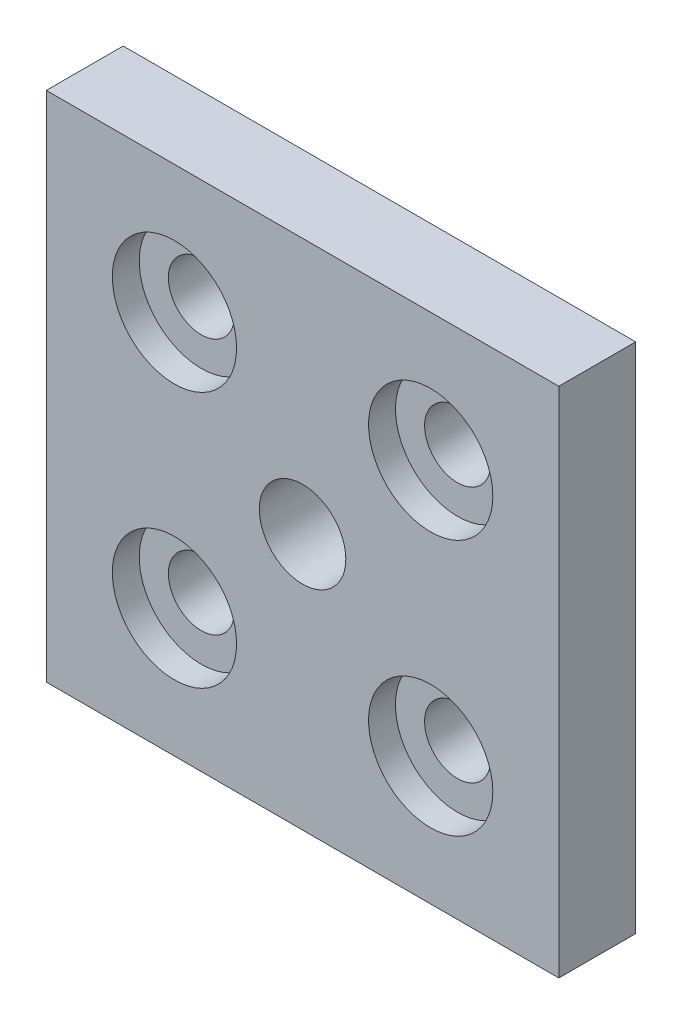
ISO-10303-21;
HEADER;
FILE_DESCRIPTION(('STEP AP214'),'2;1');
FILE_NAME('part.step','',(''),(''),'','','');
FILE_SCHEMA(('AUTOMOTIVE_DESIGN { 1 0 10303 214 1 1 1 1 }'));
ENDSEC;
DATA;
#1=APPLICATION_CONTEXT('core data for automotive mechanical design processes');
#2=APPLICATION_PROTOCOL_DEFINITION('international standard','automotive_design',2000,#1);
#3=PRODUCT_CONTEXT('',#1,'mechanical');
#4=PRODUCT('Part','Part','',(#3));
#5=PRODUCT_RELATED_PRODUCT_CATEGORY('part','',(#4));
#6=PRODUCT_DEFINITION_FORMATION('','',#4);
#7=PRODUCT_DEFINITION_CONTEXT('part definition',#1,'design');
#8=PRODUCT_DEFINITION('design','',#6,#7);
#9=PRODUCT_DEFINITION_SHAPE('','',#8);
#10=(LENGTH_UNIT() NAMED_UNIT(*) SI_UNIT(.MILLI.,.METRE.));
#11=(NAMED_UNIT(*) PLANE_ANGLE_UNIT() SI_UNIT($,.RADIAN.));
#12=(NAMED_UNIT(*) SI_UNIT($,.STERADIAN.) SOLID_ANGLE_UNIT());
#13=UNCERTAINTY_MEASURE_WITH_UNIT(LENGTH_MEASURE(1.E-05),#10,'distance_accuracy_value','');
#14=(GEOMETRIC_REPRESENTATION_CONTEXT(3) GLOBAL_UNCERTAINTY_ASSIGNED_CONTEXT((#13)) GLOBAL_UNIT_ASSIGNED_CONTEXT((#10,
#11,#12)) REPRESENTATION_CONTEXT('',''));
#15=CARTESIAN_POINT('',(0.,0.,0.));
#16=DIRECTION('',(0.,0.,1.));
#17=DIRECTION('',(1.,0.,0.));
#18=AXIS2_PLACEMENT_3D('',#15,#16,#17);
#19=CARTESIAN_POINT('',(1016.7489301358,986.409766940549,999.842344606397));
#20=DIRECTION('',(-1.,0.,0.));
#21=DIRECTION('',(0.,0.,1.));
#22=AXIS2_PLACEMENT_3D('',#19,#20,#21);
#23=PLANE('',#22);
#24=DIRECTION('',(0.,1.,0.));
#25=VECTOR('',#24,1.);
#26=CARTESIAN_POINT('',(1016.7489301358,986.409766940549,993.842344606397));
#27=LINE('',#26,#25);
#28=CARTESIAN_POINT('',(1016.7489301358,986.409766940549,993.842344606397));
#29=VERTEX_POINT('',#28);
#30=CARTESIAN_POINT('',(1016.7489301358,1026.40976694055,993.842344606397));
#31=VERTEX_POINT('',#30);
#32=EDGE_CURVE('E79',#29,#31,#27,.T.);
#33=ORIENTED_EDGE('',*,*,#32,.T.);
#34=DIRECTION('',(0.,0.,-1.));
#35=VECTOR('',#34,1.);
#36=CARTESIAN_POINT('',(1016.7489301358,1026.40976694055,999.842344606397));
#37=LINE('',#36,#35);
#38=CARTESIAN_POINT('',(1016.7489301358,1026.40976694055,999.842344606397));
#39=VERTEX_POINT('',#38);
#40=EDGE_CURVE('E10',#39,#31,#37,.T.);
#41=ORIENTED_EDGE('',*,*,#40,.F.);
#42=DIRECTION('',(0.,1.,0.));
#43=VECTOR('',#42,1.);
#44=CARTESIAN_POINT('',(1016.7489301358,986.409766940549,999.842344606397));
#45=LINE('',#44,#43);
#46=CARTESIAN_POINT('',(1016.7489301358,986.409766940549,999.842344606397));
#47=VERTEX_POINT('',#46);
#48=EDGE_CURVE('E67',#47,#39,#45,.T.);
#49=ORIENTED_EDGE('',*,*,#48,.F.);
#50=DIRECTION('',(0.,0.,-1.));
#51=VECTOR('',#50,1.);
#52=CARTESIAN_POINT('',(1016.7489301358,986.409766940549,999.842344606397));
#53=LINE('',#52,#51);
#54=EDGE_CURVE('E75',#47,#29,#53,.T.);
#55=ORIENTED_EDGE('',*,*,#54,.T.);
#56=EDGE_LOOP('',(#33,#41,#49,#55));
#57=FACE_BOUND('',#56,.T.);
#58=ADVANCED_FACE('F16',(#57),#23,.F.);
#59=CARTESIAN_POINT('',(976.748930135803,1026.40976694055,999.842344606397));
#60=DIRECTION('',(0.,-1.,0.));
#61=DIRECTION('',(0.,0.,-1.));
#62=AXIS2_PLACEMENT_3D('',#59,#60,#61);
#63=PLANE('',#62);
#64=DIRECTION('',(-1.,0.,0.));
#65=VECTOR('',#64,1.);
#66=CARTESIAN_POINT('',(976.748930135803,1026.40976694055,993.842344606397));
#67=LINE('',#66,#65);
#68=CARTESIAN_POINT('',(976.748930135803,1026.40976694055,993.842344606397));
#69=VERTEX_POINT('',#68);
#70=EDGE_CURVE('E71',#31,#69,#67,.T.);
#71=ORIENTED_EDGE('',*,*,#70,.T.);
#72=DIRECTION('',(0.,0.,-1.));
#73=VECTOR('',#72,1.);
#74=CARTESIAN_POINT('',(976.748930135803,1026.40976694055,999.842344606397));
#75=LINE('',#74,#73);
#76=CARTESIAN_POINT('',(976.748930135803,1026.40976694055,999.842344606397));
#77=VERTEX_POINT('',#76);
#78=EDGE_CURVE('E24',#77,#69,#75,.T.);
#79=ORIENTED_EDGE('',*,*,#78,.F.);
#80=DIRECTION('',(-1.,0.,0.));
#81=VECTOR('',#80,1.);
#82=CARTESIAN_POINT('',(976.748930135803,1026.40976694055,999.842344606397));
#83=LINE('',#82,#81);
#84=EDGE_CURVE('E62',#39,#77,#83,.T.);
#85=ORIENTED_EDGE('',*,*,#84,.F.);
#86=ORIENTED_EDGE('',*,*,#40,.T.);
#87=EDGE_LOOP('',(#71,#79,#85,#86));
#88=FACE_BOUND('',#87,.T.);
#89=ADVANCED_FACE('F70',(#88),#63,.F.);
#90=CARTESIAN_POINT('',(976.748930135803,986.409766940549,999.842344606397));
#91=DIRECTION('',(1.,0.,0.));
#92=DIRECTION('',(0.,0.,-1.));
#93=AXIS2_PLACEMENT_3D('',#90,#91,#92);
#94=PLANE('',#93);
#95=DIRECTION('',(0.,-1.,0.));
#96=VECTOR('',#95,1.);
#97=CARTESIAN_POINT('',(976.748930135803,986.409766940549,993.842344606397));
#98=LINE('',#97,#96);
#99=CARTESIAN_POINT('',(976.748930135803,986.409766940549,993.842344606397));
#100=VERTEX_POINT('',#99);
#101=EDGE_CURVE('E49',#69,#100,#98,.T.);
#102=ORIENTED_EDGE('',*,*,#101,.T.);
#103=DIRECTION('',(0.,0.,-1.));
#104=VECTOR('',#103,1.);
#105=CARTESIAN_POINT('',(976.748930135803,986.409766940549,999.842344606397));
#106=LINE('',#105,#104);
#107=CARTESIAN_POINT('',(976.748930135803,986.409766940549,999.842344606397));
#108=VERTEX_POINT('',#107);
#109=EDGE_CURVE('E72',#108,#100,#106,.T.);
#110=ORIENTED_EDGE('',*,*,#109,.F.);
#111=DIRECTION('',(0.,-1.,0.));
#112=VECTOR('',#111,1.);
#113=CARTESIAN_POINT('',(976.748930135803,986.409766940549,999.842344606397));
#114=LINE('',#113,#112);
#115=EDGE_CURVE('E65',#77,#108,#114,.T.);
#116=ORIENTED_EDGE('',*,*,#115,.F.);
#117=ORIENTED_EDGE('',*,*,#78,.T.);
#118=EDGE_LOOP('',(#102,#110,#116,#117));
#119=FACE_BOUND('',#118,.T.);
#120=ADVANCED_FACE('F73',(#119),#94,.F.);
#121=CARTESIAN_POINT('',(976.748930135803,986.409766940549,999.842344606397));
#122=DIRECTION('',(0.,1.,0.));
#123=DIRECTION('',(0.,0.,1.));
#124=AXIS2_PLACEMENT_3D('',#121,#122,#123);
#125=PLANE('',#124);
#126=DIRECTION('',(1.,0.,0.));
#127=VECTOR('',#126,1.);
#128=CARTESIAN_POINT('',(976.748930135803,986.409766940549,993.842344606397));
#129=LINE('',#128,#127);
#130=EDGE_CURVE('E55',#100,#29,#129,.T.);
#131=ORIENTED_EDGE('',*,*,#130,.T.);
#132=ORIENTED_EDGE('',*,*,#54,.F.);
#133=DIRECTION('',(1.,0.,0.));
#134=VECTOR('',#133,1.);
#135=CARTESIAN_POINT('',(976.748930135803,986.409766940549,999.842344606397));
#136=LINE('',#135,#134);
#137=EDGE_CURVE('E32',#108,#47,#136,.T.);
#138=ORIENTED_EDGE('',*,*,#137,.F.);
#139=ORIENTED_EDGE('',*,*,#109,.T.);
#140=EDGE_LOOP('',(#131,#132,#138,#139));
#141=FACE_BOUND('',#140,.T.);
#142=ADVANCED_FACE('F87',(#141),#125,.F.);
#143=CARTESIAN_POINT('',(996.748930135803,1006.40976694055,999.842344606397));
#144=DIRECTION('',(0.,0.,-1.));
#145=DIRECTION('',(-1.,0.,0.));
#146=AXIS2_PLACEMENT_3D('',#143,#144,#145);
#147=PLANE('',#146);
#148=CARTESIAN_POINT('',(996.748930135803,1006.40976694055,999.842344606397));
#149=DIRECTION('',(0.,0.,1.));
#150=DIRECTION('',(1.,0.,0.));
#151=AXIS2_PLACEMENT_3D('',#148,#149,#150);
#152=CIRCLE('',#151,3.375);
#153=CARTESIAN_POINT('',(1000.1239301358,1006.40976694055,999.842344606397));
#154=VERTEX_POINT('',#153);
#155=EDGE_CURVE('E141',#154,#154,#152,.T.);
#156=ORIENTED_EDGE('',*,*,#155,.F.);
#157=EDGE_LOOP('',(#156));
#158=FACE_BOUND('',#157,.T.);
#159=CARTESIAN_POINT('',(1006.7489301358,1016.40976694055,999.842344606397));
#160=DIRECTION('',(0.,0.,1.));
#161=DIRECTION('',(1.,0.,0.));
#162=AXIS2_PLACEMENT_3D('',#159,#160,#161);
#163=CIRCLE('',#162,4.85);
#164=CARTESIAN_POINT('',(1011.5989301358,1016.40976694055,999.842344606397));
#165=VERTEX_POINT('',#164);
#166=EDGE_CURVE('E96',#165,#165,#163,.T.);
#167=ORIENTED_EDGE('',*,*,#166,.F.);
#168=EDGE_LOOP('',(#167));
#169=FACE_BOUND('',#168,.T.);
#170=CARTESIAN_POINT('',(986.748930135803,996.409766940549,999.842344606397));
#171=DIRECTION('',(0.,0.,1.));
#172=DIRECTION('',(1.,0.,0.));
#173=AXIS2_PLACEMENT_3D('',#170,#171,#172);
#174=CIRCLE('',#173,4.85);
#175=CARTESIAN_POINT('',(991.598930135803,996.409766940549,999.842344606397));
#176=VERTEX_POINT('',#175);
#177=EDGE_CURVE('E102',#176,#176,#174,.T.);
#178=ORIENTED_EDGE('',*,*,#177,.F.);
#179=EDGE_LOOP('',(#178));
#180=FACE_BOUND('',#179,.T.);
#181=CARTESIAN_POINT('',(1006.7489301358,996.409766940549,999.842344606397));
#182=DIRECTION('',(0.,0.,1.));
#183=DIRECTION('',(1.,0.,0.));
#184=AXIS2_PLACEMENT_3D('',#181,#182,#183);
#185=CIRCLE('',#184,4.85);
#186=CARTESIAN_POINT('',(1011.5989301358,996.409766940549,999.842344606397));
#187=VERTEX_POINT('',#186);
#188=EDGE_CURVE('E103',#187,#187,#185,.T.);
#189=ORIENTED_EDGE('',*,*,#188,.F.);
#190=EDGE_LOOP('',(#189));
#191=FACE_BOUND('',#190,.T.);
#192=CARTESIAN_POINT('',(986.748930135803,1016.40976694055,999.842344606397));
#193=DIRECTION('',(0.,0.,1.));
#194=DIRECTION('',(1.,0.,0.));
#195=AXIS2_PLACEMENT_3D('',#192,#193,#194);
#196=CIRCLE('',#195,4.85);
#197=CARTESIAN_POINT('',(991.598930135803,1016.40976694055,999.842344606397));
#198=VERTEX_POINT('',#197);
#199=EDGE_CURVE('E93',#198,#198,#196,.T.);
#200=ORIENTED_EDGE('',*,*,#199,.F.);
#201=EDGE_LOOP('',(#200));
#202=FACE_BOUND('',#201,.T.);
#203=ORIENTED_EDGE('',*,*,#48,.T.);
#204=ORIENTED_EDGE('',*,*,#84,.T.);
#205=ORIENTED_EDGE('',*,*,#115,.T.);
#206=ORIENTED_EDGE('',*,*,#137,.T.);
#207=EDGE_LOOP('',(#203,#204,#205,#206));
#208=FACE_BOUND('',#207,.T.);
#209=ADVANCED_FACE('F63',(#158,#169,#180,#191,#202,#208),#147,.F.);
#210=CARTESIAN_POINT('',(996.748930135803,1006.40976694055,993.842344606397));
#211=DIRECTION('',(0.,0.,-1.));
#212=DIRECTION('',(-1.,0.,0.));
#213=AXIS2_PLACEMENT_3D('',#210,#211,#212);
#214=PLANE('',#213);
#215=CARTESIAN_POINT('',(996.748930135803,1006.40976694055,993.842344606397));
#216=DIRECTION('',(0.,0.,1.));
#217=DIRECTION('',(1.,0.,0.));
#218=AXIS2_PLACEMENT_3D('',#215,#216,#217);
#219=CIRCLE('',#218,3.375);
#220=CARTESIAN_POINT('',(1000.1239301358,1006.40976694055,993.842344606397));
#221=VERTEX_POINT('',#220);
#222=EDGE_CURVE('E138',#221,#221,#219,.T.);
#223=ORIENTED_EDGE('',*,*,#222,.T.);
#224=EDGE_LOOP('',(#223));
#225=FACE_BOUND('',#224,.T.);
#226=CARTESIAN_POINT('',(1006.7489301358,1016.40976694055,993.842344606397));
#227=DIRECTION('',(0.,0.,1.));
#228=DIRECTION('',(1.,0.,0.));
#229=AXIS2_PLACEMENT_3D('',#226,#227,#228);
#230=CIRCLE('',#229,2.575);
#231=CARTESIAN_POINT('',(1009.3239301358,1016.40976694055,993.842344606397));
#232=VERTEX_POINT('',#231);
#233=EDGE_CURVE('E130',#232,#232,#230,.T.);
#234=ORIENTED_EDGE('',*,*,#233,.T.);
#235=EDGE_LOOP('',(#234));
#236=FACE_BOUND('',#235,.T.);
#237=CARTESIAN_POINT('',(986.748930135803,996.409766940549,993.842344606397));
#238=DIRECTION('',(0.,0.,1.));
#239=DIRECTION('',(1.,0.,0.));
#240=AXIS2_PLACEMENT_3D('',#237,#238,#239);
#241=CIRCLE('',#240,2.575);
#242=CARTESIAN_POINT('',(989.323930135803,996.409766940549,993.842344606397));
#243=VERTEX_POINT('',#242);
#244=EDGE_CURVE('E123',#243,#243,#241,.T.);
#245=ORIENTED_EDGE('',*,*,#244,.T.);
#246=EDGE_LOOP('',(#245));
#247=FACE_BOUND('',#246,.T.);
#248=CARTESIAN_POINT('',(1006.7489301358,996.409766940549,993.842344606397));
#249=DIRECTION('',(0.,0.,1.));
#250=DIRECTION('',(1.,0.,0.));
#251=AXIS2_PLACEMENT_3D('',#248,#249,#250);
#252=CIRCLE('',#251,2.575);
#253=CARTESIAN_POINT('',(1009.3239301358,996.409766940549,993.842344606397));
#254=VERTEX_POINT('',#253);
#255=EDGE_CURVE('E135',#254,#254,#252,.T.);
#256=ORIENTED_EDGE('',*,*,#255,.T.);
#257=EDGE_LOOP('',(#256));
#258=FACE_BOUND('',#257,.T.);
#259=CARTESIAN_POINT('',(986.748930135803,1016.40976694055,993.842344606397));
#260=DIRECTION('',(0.,0.,1.));
#261=DIRECTION('',(1.,0.,0.));
#262=AXIS2_PLACEMENT_3D('',#259,#260,#261);
#263=CIRCLE('',#262,2.575);
#264=CARTESIAN_POINT('',(989.323930135803,1016.40976694055,993.842344606397));
#265=VERTEX_POINT('',#264);
#266=EDGE_CURVE('E114',#265,#265,#263,.T.);
#267=ORIENTED_EDGE('',*,*,#266,.T.);
#268=EDGE_LOOP('',(#267));
#269=FACE_BOUND('',#268,.T.);
#270=ORIENTED_EDGE('',*,*,#32,.F.);
#271=ORIENTED_EDGE('',*,*,#130,.F.);
#272=ORIENTED_EDGE('',*,*,#101,.F.);
#273=ORIENTED_EDGE('',*,*,#70,.F.);
#274=EDGE_LOOP('',(#270,#271,#272,#273));
#275=FACE_BOUND('',#274,.T.);
#276=ADVANCED_FACE('F90',(#225,#236,#247,#258,#269,#275),#214,.T.);
#277=CARTESIAN_POINT('',(986.748930135803,1016.40976694055,997.742344606397));
#278=DIRECTION('',(0.,0.,1.));
#279=DIRECTION('',(1.,0.,0.));
#280=AXIS2_PLACEMENT_3D('',#277,#278,#279);
#281=CYLINDRICAL_SURFACE('',#280,4.85);
#282=CARTESIAN_POINT('',(986.748930135803,1016.40976694055,997.742344606397));
#283=DIRECTION('',(0.,0.,1.));
#284=DIRECTION('',(1.,0.,0.));
#285=AXIS2_PLACEMENT_3D('',#282,#283,#284);
#286=CIRCLE('',#285,4.85);
#287=CARTESIAN_POINT('',(991.598930135803,1016.40976694055,997.742344606397));
#288=VERTEX_POINT('',#287);
#289=EDGE_CURVE('E82',#288,#288,#286,.T.);
#290=ORIENTED_EDGE('',*,*,#289,.F.);
#291=EDGE_LOOP('',(#290));
#292=FACE_BOUND('',#291,.T.);
#293=ORIENTED_EDGE('',*,*,#199,.T.);
#294=EDGE_LOOP('',(#293));
#295=FACE_BOUND('',#294,.T.);
#296=ADVANCED_FACE('F167',(#292,#295),#281,.F.);
#297=CARTESIAN_POINT('',(986.748930135803,1016.40976694055,997.742344606397));
#298=DIRECTION('',(0.,0.,1.));
#299=DIRECTION('',(1.,0.,0.));
#300=AXIS2_PLACEMENT_3D('',#297,#298,#299);
#301=PLANE('',#300);
#302=CARTESIAN_POINT('',(986.748930135803,1016.40976694055,997.742344606397));
#303=DIRECTION('',(0.,0.,1.));
#304=DIRECTION('',(1.,0.,0.));
#305=AXIS2_PLACEMENT_3D('',#302,#303,#304);
#306=CIRCLE('',#305,2.575);
#307=CARTESIAN_POINT('',(989.323930135803,1016.40976694055,997.742344606397));
#308=VERTEX_POINT('',#307);
#309=EDGE_CURVE('E117',#308,#308,#306,.T.);
#310=ORIENTED_EDGE('',*,*,#309,.F.);
#311=EDGE_LOOP('',(#310));
#312=FACE_BOUND('',#311,.T.);
#313=ORIENTED_EDGE('',*,*,#289,.T.);
#314=EDGE_LOOP('',(#313));
#315=FACE_BOUND('',#314,.T.);
#316=ADVANCED_FACE('F169',(#312,#315),#301,.T.);
#317=CARTESIAN_POINT('',(1006.7489301358,996.409766940549,997.742344606397));
#318=DIRECTION('',(0.,0.,1.));
#319=DIRECTION('',(1.,0.,0.));
#320=AXIS2_PLACEMENT_3D('',#317,#318,#319);
#321=CYLINDRICAL_SURFACE('',#320,4.85);
#322=CARTESIAN_POINT('',(1006.7489301358,996.409766940549,997.742344606397));
#323=DIRECTION('',(0.,0.,1.));
#324=DIRECTION('',(1.,0.,0.));
#325=AXIS2_PLACEMENT_3D('',#322,#323,#324);
#326=CIRCLE('',#325,4.85);
#327=CARTESIAN_POINT('',(1011.5989301358,996.409766940549,997.742344606397));
#328=VERTEX_POINT('',#327);
#329=EDGE_CURVE('E111',#328,#328,#326,.T.);
#330=ORIENTED_EDGE('',*,*,#329,.F.);
#331=EDGE_LOOP('',(#330));
#332=FACE_BOUND('',#331,.T.);
#333=ORIENTED_EDGE('',*,*,#188,.T.);
#334=EDGE_LOOP('',(#333));
#335=FACE_BOUND('',#334,.T.);
#336=ADVANCED_FACE('F177',(#332,#335),#321,.F.);
#337=CARTESIAN_POINT('',(1006.7489301358,996.409766940549,997.742344606397));
#338=DIRECTION('',(0.,0.,1.));
#339=DIRECTION('',(1.,0.,0.));
#340=AXIS2_PLACEMENT_3D('',#337,#338,#339);
#341=PLANE('',#340);
#342=CARTESIAN_POINT('',(1006.7489301358,996.409766940549,997.742344606397));
#343=DIRECTION('',(0.,0.,1.));
#344=DIRECTION('',(1.,0.,0.));
#345=AXIS2_PLACEMENT_3D('',#342,#343,#344);
#346=CIRCLE('',#345,2.575);
#347=CARTESIAN_POINT('',(1009.3239301358,996.409766940549,997.742344606397));
#348=VERTEX_POINT('',#347);
#349=EDGE_CURVE('E127',#348,#348,#346,.T.);
#350=ORIENTED_EDGE('',*,*,#349,.F.);
#351=EDGE_LOOP('',(#350));
#352=FACE_BOUND('',#351,.T.);
#353=ORIENTED_EDGE('',*,*,#329,.T.);
#354=EDGE_LOOP('',(#353));
#355=FACE_BOUND('',#354,.T.);
#356=ADVANCED_FACE('F228',(#352,#355),#341,.T.);
#357=CARTESIAN_POINT('',(986.748930135803,996.409766940549,997.742344606397));
#358=DIRECTION('',(0.,0.,1.));
#359=DIRECTION('',(1.,0.,0.));
#360=AXIS2_PLACEMENT_3D('',#357,#358,#359);
#361=CYLINDRICAL_SURFACE('',#360,4.85);
#362=CARTESIAN_POINT('',(986.748930135803,996.409766940549,997.742344606397));
#363=DIRECTION('',(0.,0.,1.));
#364=DIRECTION('',(1.,0.,0.));
#365=AXIS2_PLACEMENT_3D('',#362,#363,#364);
#366=CIRCLE('',#365,4.85);
#367=CARTESIAN_POINT('',(991.598930135803,996.409766940549,997.742344606397));
#368=VERTEX_POINT('',#367);
#369=EDGE_CURVE('E99',#368,#368,#366,.T.);
#370=ORIENTED_EDGE('',*,*,#369,.F.);
#371=EDGE_LOOP('',(#370));
#372=FACE_BOUND('',#371,.T.);
#373=ORIENTED_EDGE('',*,*,#177,.T.);
#374=EDGE_LOOP('',(#373));
#375=FACE_BOUND('',#374,.T.);
#376=ADVANCED_FACE('F238',(#372,#375),#361,.F.);
#377=CARTESIAN_POINT('',(986.748930135803,996.409766940549,997.742344606397));
#378=DIRECTION('',(0.,0.,1.));
#379=DIRECTION('',(1.,0.,0.));
#380=AXIS2_PLACEMENT_3D('',#377,#378,#379);
#381=PLANE('',#380);
#382=CARTESIAN_POINT('',(986.748930135803,996.409766940549,997.742344606397));
#383=DIRECTION('',(0.,0.,1.));
#384=DIRECTION('',(1.,0.,0.));
#385=AXIS2_PLACEMENT_3D('',#382,#383,#384);
#386=CIRCLE('',#385,2.575);
#387=CARTESIAN_POINT('',(989.323930135803,996.409766940549,997.742344606397));
#388=VERTEX_POINT('',#387);
#389=EDGE_CURVE('E126',#388,#388,#386,.T.);
#390=ORIENTED_EDGE('',*,*,#389,.F.);
#391=EDGE_LOOP('',(#390));
#392=FACE_BOUND('',#391,.T.);
#393=ORIENTED_EDGE('',*,*,#369,.T.);
#394=EDGE_LOOP('',(#393));
#395=FACE_BOUND('',#394,.T.);
#396=ADVANCED_FACE('F248',(#392,#395),#381,.T.);
#397=CARTESIAN_POINT('',(1006.7489301358,1016.40976694055,997.742344606397));
#398=DIRECTION('',(0.,0.,1.));
#399=DIRECTION('',(1.,0.,0.));
#400=AXIS2_PLACEMENT_3D('',#397,#398,#399);
#401=CYLINDRICAL_SURFACE('',#400,4.85);
#402=CARTESIAN_POINT('',(1006.7489301358,1016.40976694055,997.742344606397));
#403=DIRECTION('',(0.,0.,1.));
#404=DIRECTION('',(1.,0.,0.));
#405=AXIS2_PLACEMENT_3D('',#402,#403,#404);
#406=CIRCLE('',#405,4.85);
#407=CARTESIAN_POINT('',(1011.5989301358,1016.40976694055,997.742344606397));
#408=VERTEX_POINT('',#407);
#409=EDGE_CURVE('E106',#408,#408,#406,.T.);
#410=ORIENTED_EDGE('',*,*,#409,.F.);
#411=EDGE_LOOP('',(#410));
#412=FACE_BOUND('',#411,.T.);
#413=ORIENTED_EDGE('',*,*,#166,.T.);
#414=EDGE_LOOP('',(#413));
#415=FACE_BOUND('',#414,.T.);
#416=ADVANCED_FACE('F258',(#412,#415),#401,.F.);
#417=CARTESIAN_POINT('',(1006.7489301358,1016.40976694055,997.742344606397));
#418=DIRECTION('',(0.,0.,1.));
#419=DIRECTION('',(1.,0.,0.));
#420=AXIS2_PLACEMENT_3D('',#417,#418,#419);
#421=PLANE('',#420);
#422=CARTESIAN_POINT('',(1006.7489301358,1016.40976694055,997.742344606397));
#423=DIRECTION('',(0.,0.,1.));
#424=DIRECTION('',(1.,0.,0.));
#425=AXIS2_PLACEMENT_3D('',#422,#423,#424);
#426=CIRCLE('',#425,2.575);
#427=CARTESIAN_POINT('',(1009.3239301358,1016.40976694055,997.742344606397));
#428=VERTEX_POINT('',#427);
#429=EDGE_CURVE('E120',#428,#428,#426,.T.);
#430=ORIENTED_EDGE('',*,*,#429,.F.);
#431=EDGE_LOOP('',(#430));
#432=FACE_BOUND('',#431,.T.);
#433=ORIENTED_EDGE('',*,*,#409,.T.);
#434=EDGE_LOOP('',(#433));
#435=FACE_BOUND('',#434,.T.);
#436=ADVANCED_FACE('F268',(#432,#435),#421,.T.);
#437=CARTESIAN_POINT('',(986.748930135803,1016.40976694055,993.842344606397));
#438=DIRECTION('',(0.,0.,1.));
#439=DIRECTION('',(1.,0.,0.));
#440=AXIS2_PLACEMENT_3D('',#437,#438,#439);
#441=CYLINDRICAL_SURFACE('',#440,2.575);
#442=ORIENTED_EDGE('',*,*,#266,.F.);
#443=EDGE_LOOP('',(#442));
#444=FACE_BOUND('',#443,.T.);
#445=ORIENTED_EDGE('',*,*,#309,.T.);
#446=EDGE_LOOP('',(#445));
#447=FACE_BOUND('',#446,.T.);
#448=ADVANCED_FACE('F278',(#444,#447),#441,.F.);
#449=CARTESIAN_POINT('',(1006.7489301358,996.409766940549,993.842344606397));
#450=DIRECTION('',(0.,0.,1.));
#451=DIRECTION('',(1.,0.,0.));
#452=AXIS2_PLACEMENT_3D('',#449,#450,#451);
#453=CYLINDRICAL_SURFACE('',#452,2.575);
#454=ORIENTED_EDGE('',*,*,#255,.F.);
#455=EDGE_LOOP('',(#454));
#456=FACE_BOUND('',#455,.T.);
#457=ORIENTED_EDGE('',*,*,#349,.T.);
#458=EDGE_LOOP('',(#457));
#459=FACE_BOUND('',#458,.T.);
#460=ADVANCED_FACE('F288',(#456,#459),#453,.F.);
#461=CARTESIAN_POINT('',(986.748930135803,996.409766940549,993.842344606397));
#462=DIRECTION('',(0.,0.,1.));
#463=DIRECTION('',(1.,0.,0.));
#464=AXIS2_PLACEMENT_3D('',#461,#462,#463);
#465=CYLINDRICAL_SURFACE('',#464,2.575);
#466=ORIENTED_EDGE('',*,*,#244,.F.);
#467=EDGE_LOOP('',(#466));
#468=FACE_BOUND('',#467,.T.);
#469=ORIENTED_EDGE('',*,*,#389,.T.);
#470=EDGE_LOOP('',(#469));
#471=FACE_BOUND('',#470,.T.);
#472=ADVANCED_FACE('F298',(#468,#471),#465,.F.);
#473=CARTESIAN_POINT('',(1006.7489301358,1016.40976694055,993.842344606397));
#474=DIRECTION('',(0.,0.,1.));
#475=DIRECTION('',(1.,0.,0.));
#476=AXIS2_PLACEMENT_3D('',#473,#474,#475);
#477=CYLINDRICAL_SURFACE('',#476,2.575);
#478=ORIENTED_EDGE('',*,*,#233,.F.);
#479=EDGE_LOOP('',(#478));
#480=FACE_BOUND('',#479,.T.);
#481=ORIENTED_EDGE('',*,*,#429,.T.);
#482=EDGE_LOOP('',(#481));
#483=FACE_BOUND('',#482,.T.);
#484=ADVANCED_FACE('F152',(#480,#483),#477,.F.);
#485=CARTESIAN_POINT('',(996.748930135803,1006.40976694055,993.842344606397));
#486=DIRECTION('',(0.,0.,1.));
#487=DIRECTION('',(1.,0.,0.));
#488=AXIS2_PLACEMENT_3D('',#485,#486,#487);
#489=CYLINDRICAL_SURFACE('',#488,3.375);
#490=ORIENTED_EDGE('',*,*,#222,.F.);
#491=EDGE_LOOP('',(#490));
#492=FACE_BOUND('',#491,.T.);
#493=ORIENTED_EDGE('',*,*,#155,.T.);
#494=EDGE_LOOP('',(#493));
#495=FACE_BOUND('',#494,.T.);
#496=ADVANCED_FACE('F149',(#492,#495),#489,.F.);
#497=CLOSED_SHELL('',(#58,#89,#120,#142,#209,#276,#296,#316,#336,#356,#376,#396,#416,#436,#448,
#460,#472,#484,#496));
#498=MANIFOLD_SOLID_BREP('B1',#497);
#499=ADVANCED_BREP_SHAPE_REPRESENTATION('',(#18,#498),#14);
#500=SHAPE_DEFINITION_REPRESENTATION(#9,#499);
ENDSEC;
END-ISO-10303-21;
